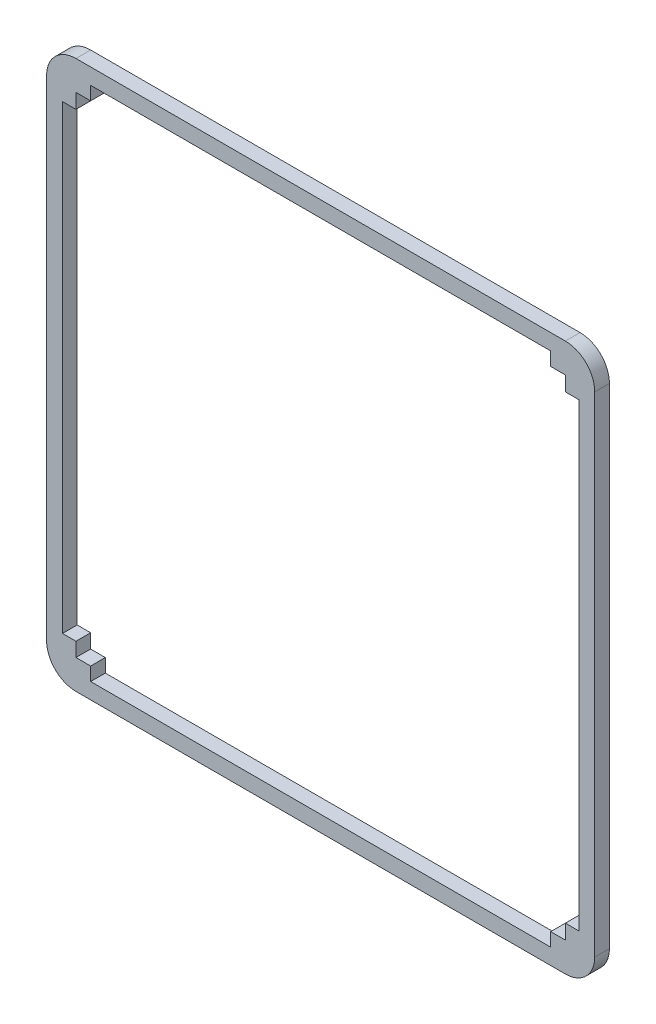
ISO-10303-21;
HEADER;
FILE_DESCRIPTION(('STEP AP214'),'2;1');
FILE_NAME('part.step','',(''),(''),'','','');
FILE_SCHEMA(('AUTOMOTIVE_DESIGN { 1 0 10303 214 1 1 1 1 }'));
ENDSEC;
DATA;
#1=APPLICATION_CONTEXT('core data for automotive mechanical design processes');
#2=APPLICATION_PROTOCOL_DEFINITION('international standard','automotive_design',2000,#1);
#3=PRODUCT_CONTEXT('',#1,'mechanical');
#4=PRODUCT('Part','Part','',(#3));
#5=PRODUCT_RELATED_PRODUCT_CATEGORY('part','',(#4));
#6=PRODUCT_DEFINITION_FORMATION('','',#4);
#7=PRODUCT_DEFINITION_CONTEXT('part definition',#1,'design');
#8=PRODUCT_DEFINITION('design','',#6,#7);
#9=PRODUCT_DEFINITION_SHAPE('','',#8);
#10=(LENGTH_UNIT() NAMED_UNIT(*) SI_UNIT(.MILLI.,.METRE.));
#11=(NAMED_UNIT(*) PLANE_ANGLE_UNIT() SI_UNIT($,.RADIAN.));
#12=(NAMED_UNIT(*) SI_UNIT($,.STERADIAN.) SOLID_ANGLE_UNIT());
#13=UNCERTAINTY_MEASURE_WITH_UNIT(LENGTH_MEASURE(1.E-05),#10,'distance_accuracy_value','');
#14=(GEOMETRIC_REPRESENTATION_CONTEXT(3) GLOBAL_UNCERTAINTY_ASSIGNED_CONTEXT((#13)) GLOBAL_UNIT_ASSIGNED_CONTEXT((#10,
#11,#12)) REPRESENTATION_CONTEXT('',''));
#15=CARTESIAN_POINT('',(0.,0.,0.));
#16=DIRECTION('',(0.,0.,1.));
#17=DIRECTION('',(1.,0.,0.));
#18=AXIS2_PLACEMENT_3D('',#15,#16,#17);
#19=CARTESIAN_POINT('',(0.,-6.,3.));
#20=DIRECTION('',(0.,1.,0.));
#21=DIRECTION('',(0.,0.,1.));
#22=AXIS2_PLACEMENT_3D('',#19,#20,#21);
#23=PLANE('',#22);
#24=DIRECTION('',(1.,0.,0.));
#25=VECTOR('',#24,1.);
#26=CARTESIAN_POINT('',(0.,-6.,0.));
#27=LINE('',#26,#25);
#28=CARTESIAN_POINT('',(0.,-6.,0.));
#29=VERTEX_POINT('',#28);
#30=CARTESIAN_POINT('',(100.,-6.,0.));
#31=VERTEX_POINT('',#30);
#32=EDGE_CURVE('E335',#29,#31,#27,.T.);
#33=ORIENTED_EDGE('',*,*,#32,.T.);
#34=DIRECTION('',(0.,0.,-1.));
#35=VECTOR('',#34,1.);
#36=CARTESIAN_POINT('',(100.,-6.,3.));
#37=LINE('',#36,#35);
#38=CARTESIAN_POINT('',(100.,-6.,3.));
#39=VERTEX_POINT('',#38);
#40=EDGE_CURVE('E11',#39,#31,#37,.T.);
#41=ORIENTED_EDGE('',*,*,#40,.F.);
#42=DIRECTION('',(1.,0.,0.));
#43=VECTOR('',#42,1.);
#44=CARTESIAN_POINT('',(0.,-6.,3.));
#45=LINE('',#44,#43);
#46=CARTESIAN_POINT('',(0.,-6.,3.));
#47=VERTEX_POINT('',#46);
#48=EDGE_CURVE('E474',#47,#39,#45,.T.);
#49=ORIENTED_EDGE('',*,*,#48,.F.);
#50=DIRECTION('',(0.,0.,-1.));
#51=VECTOR('',#50,1.);
#52=CARTESIAN_POINT('',(0.,-6.,3.));
#53=LINE('',#52,#51);
#54=EDGE_CURVE('E61',#47,#29,#53,.T.);
#55=ORIENTED_EDGE('',*,*,#54,.T.);
#56=EDGE_LOOP('',(#33,#41,#49,#55));
#57=FACE_BOUND('',#56,.T.);
#58=ADVANCED_FACE('F41',(#57),#23,.F.);
#59=CARTESIAN_POINT('',(100.,0.,3.));
#60=DIRECTION('',(0.,0.,-1.));
#61=DIRECTION('',(-1.,0.,0.));
#62=AXIS2_PLACEMENT_3D('',#59,#60,#61);
#63=CYLINDRICAL_SURFACE('',#62,6.00000000000001);
#64=CARTESIAN_POINT('',(100.,0.,0.));
#65=DIRECTION('',(0.,0.,1.));
#66=DIRECTION('',(1.,0.,0.));
#67=AXIS2_PLACEMENT_3D('',#64,#65,#66);
#68=CIRCLE('',#67,6.00000000000001);
#69=CARTESIAN_POINT('',(106.,0.,0.));
#70=VERTEX_POINT('',#69);
#71=EDGE_CURVE('E338',#31,#70,#68,.T.);
#72=ORIENTED_EDGE('',*,*,#71,.T.);
#73=DIRECTION('',(0.,0.,-1.));
#74=VECTOR('',#73,1.);
#75=CARTESIAN_POINT('',(106.,0.,3.));
#76=LINE('',#75,#74);
#77=CARTESIAN_POINT('',(106.,0.,3.));
#78=VERTEX_POINT('',#77);
#79=EDGE_CURVE('E52',#78,#70,#76,.T.);
#80=ORIENTED_EDGE('',*,*,#79,.F.);
#81=CARTESIAN_POINT('',(100.,0.,3.));
#82=DIRECTION('',(0.,0.,1.));
#83=DIRECTION('',(1.,0.,0.));
#84=AXIS2_PLACEMENT_3D('',#81,#82,#83);
#85=CIRCLE('',#84,6.00000000000001);
#86=EDGE_CURVE('E480',#39,#78,#85,.T.);
#87=ORIENTED_EDGE('',*,*,#86,.F.);
#88=ORIENTED_EDGE('',*,*,#40,.T.);
#89=EDGE_LOOP('',(#72,#80,#87,#88));
#90=FACE_BOUND('',#89,.T.);
#91=ADVANCED_FACE('F607',(#90),#63,.T.);
#92=CARTESIAN_POINT('',(106.,0.,3.));
#93=DIRECTION('',(-1.,0.,0.));
#94=DIRECTION('',(0.,0.,1.));
#95=AXIS2_PLACEMENT_3D('',#92,#93,#94);
#96=PLANE('',#95);
#97=DIRECTION('',(0.,1.,0.));
#98=VECTOR('',#97,1.);
#99=CARTESIAN_POINT('',(106.,0.,0.));
#100=LINE('',#99,#98);
#101=CARTESIAN_POINT('',(106.,100.,0.));
#102=VERTEX_POINT('',#101);
#103=EDGE_CURVE('E341',#70,#102,#100,.T.);
#104=ORIENTED_EDGE('',*,*,#103,.T.);
#105=DIRECTION('',(0.,0.,-1.));
#106=VECTOR('',#105,1.);
#107=CARTESIAN_POINT('',(106.,100.,3.));
#108=LINE('',#107,#106);
#109=CARTESIAN_POINT('',(106.,100.,3.));
#110=VERTEX_POINT('',#109);
#111=EDGE_CURVE('E371',#110,#102,#108,.T.);
#112=ORIENTED_EDGE('',*,*,#111,.F.);
#113=DIRECTION('',(0.,1.,0.));
#114=VECTOR('',#113,1.);
#115=CARTESIAN_POINT('',(106.,0.,3.));
#116=LINE('',#115,#114);
#117=EDGE_CURVE('E579',#78,#110,#116,.T.);
#118=ORIENTED_EDGE('',*,*,#117,.F.);
#119=ORIENTED_EDGE('',*,*,#79,.T.);
#120=EDGE_LOOP('',(#104,#112,#118,#119));
#121=FACE_BOUND('',#120,.T.);
#122=ADVANCED_FACE('F612',(#121),#96,.F.);
#123=CARTESIAN_POINT('',(100.,100.,3.));
#124=DIRECTION('',(0.,0.,-1.));
#125=DIRECTION('',(-1.,0.,0.));
#126=AXIS2_PLACEMENT_3D('',#123,#124,#125);
#127=CYLINDRICAL_SURFACE('',#126,6.00000000000003);
#128=CARTESIAN_POINT('',(100.,100.,0.));
#129=DIRECTION('',(0.,0.,1.));
#130=DIRECTION('',(1.,0.,0.));
#131=AXIS2_PLACEMENT_3D('',#128,#129,#130);
#132=CIRCLE('',#131,6.00000000000003);
#133=CARTESIAN_POINT('',(100.,106.,0.));
#134=VERTEX_POINT('',#133);
#135=EDGE_CURVE('E344',#102,#134,#132,.T.);
#136=ORIENTED_EDGE('',*,*,#135,.T.);
#137=DIRECTION('',(0.,0.,-1.));
#138=VECTOR('',#137,1.);
#139=CARTESIAN_POINT('',(100.,106.,3.));
#140=LINE('',#139,#138);
#141=CARTESIAN_POINT('',(100.,106.,3.));
#142=VERTEX_POINT('',#141);
#143=EDGE_CURVE('E368',#142,#134,#140,.T.);
#144=ORIENTED_EDGE('',*,*,#143,.F.);
#145=CARTESIAN_POINT('',(100.,100.,3.));
#146=DIRECTION('',(0.,0.,1.));
#147=DIRECTION('',(1.,0.,0.));
#148=AXIS2_PLACEMENT_3D('',#145,#146,#147);
#149=CIRCLE('',#148,6.00000000000003);
#150=EDGE_CURVE('E263',#110,#142,#149,.T.);
#151=ORIENTED_EDGE('',*,*,#150,.F.);
#152=ORIENTED_EDGE('',*,*,#111,.T.);
#153=EDGE_LOOP('',(#136,#144,#151,#152));
#154=FACE_BOUND('',#153,.T.);
#155=ADVANCED_FACE('F587',(#154),#127,.T.);
#156=CARTESIAN_POINT('',(0.,106.,3.));
#157=DIRECTION('',(0.,1.,0.));
#158=DIRECTION('',(0.,0.,1.));
#159=AXIS2_PLACEMENT_3D('',#156,#157,#158);
#160=PLANE('',#159);
#161=DIRECTION('',(1.,0.,0.));
#162=VECTOR('',#161,1.);
#163=CARTESIAN_POINT('',(0.,106.,0.));
#164=LINE('',#163,#162);
#165=CARTESIAN_POINT('',(0.,106.,0.));
#166=VERTEX_POINT('',#165);
#167=EDGE_CURVE('E348',#166,#134,#164,.T.);
#168=ORIENTED_EDGE('',*,*,#167,.F.);
#169=DIRECTION('',(0.,0.,-1.));
#170=VECTOR('',#169,1.);
#171=CARTESIAN_POINT('',(0.,106.,3.));
#172=LINE('',#171,#170);
#173=CARTESIAN_POINT('',(0.,106.,3.));
#174=VERTEX_POINT('',#173);
#175=EDGE_CURVE('E246',#174,#166,#172,.T.);
#176=ORIENTED_EDGE('',*,*,#175,.F.);
#177=DIRECTION('',(1.,0.,0.));
#178=VECTOR('',#177,1.);
#179=CARTESIAN_POINT('',(0.,106.,3.));
#180=LINE('',#179,#178);
#181=EDGE_CURVE('E259',#174,#142,#180,.T.);
#182=ORIENTED_EDGE('',*,*,#181,.T.);
#183=ORIENTED_EDGE('',*,*,#143,.T.);
#184=EDGE_LOOP('',(#168,#176,#182,#183));
#185=FACE_BOUND('',#184,.T.);
#186=ADVANCED_FACE('F591',(#185),#160,.T.);
#187=CARTESIAN_POINT('',(0.,100.,3.));
#188=DIRECTION('',(0.,0.,-1.));
#189=DIRECTION('',(-1.,0.,0.));
#190=AXIS2_PLACEMENT_3D('',#187,#188,#189);
#191=CYLINDRICAL_SURFACE('',#190,6.00000000000001);
#192=CARTESIAN_POINT('',(0.,100.,0.));
#193=DIRECTION('',(0.,0.,1.));
#194=DIRECTION('',(1.,0.,0.));
#195=AXIS2_PLACEMENT_3D('',#192,#193,#194);
#196=CIRCLE('',#195,6.00000000000001);
#197=CARTESIAN_POINT('',(-6.,100.,0.));
#198=VERTEX_POINT('',#197);
#199=EDGE_CURVE('E242',#198,#166,#196,.F.);
#200=ORIENTED_EDGE('',*,*,#199,.F.);
#201=DIRECTION('',(0.,0.,-1.));
#202=VECTOR('',#201,1.);
#203=CARTESIAN_POINT('',(-6.,100.,3.));
#204=LINE('',#203,#202);
#205=CARTESIAN_POINT('',(-6.,100.,3.));
#206=VERTEX_POINT('',#205);
#207=EDGE_CURVE('E236',#206,#198,#204,.T.);
#208=ORIENTED_EDGE('',*,*,#207,.F.);
#209=CARTESIAN_POINT('',(0.,100.,3.));
#210=DIRECTION('',(0.,0.,1.));
#211=DIRECTION('',(1.,0.,0.));
#212=AXIS2_PLACEMENT_3D('',#209,#210,#211);
#213=CIRCLE('',#212,6.00000000000001);
#214=EDGE_CURVE('E240',#206,#174,#213,.F.);
#215=ORIENTED_EDGE('',*,*,#214,.T.);
#216=ORIENTED_EDGE('',*,*,#175,.T.);
#217=EDGE_LOOP('',(#200,#208,#215,#216));
#218=FACE_BOUND('',#217,.T.);
#219=ADVANCED_FACE('F238',(#218),#191,.T.);
#220=CARTESIAN_POINT('',(-5.99999999999999,0.,3.));
#221=DIRECTION('',(1.,0.,0.));
#222=DIRECTION('',(0.,1.,0.));
#223=AXIS2_PLACEMENT_3D('',#220,#221,#222);
#224=PLANE('',#223);
#225=DIRECTION('',(0.,-1.,0.));
#226=VECTOR('',#225,1.);
#227=CARTESIAN_POINT('',(-5.99999999999999,0.,0.));
#228=LINE('',#227,#226);
#229=CARTESIAN_POINT('',(-5.99999999999999,0.,0.));
#230=VERTEX_POINT('',#229);
#231=EDGE_CURVE('E354',#198,#230,#228,.T.);
#232=ORIENTED_EDGE('',*,*,#231,.T.);
#233=DIRECTION('',(0.,0.,-1.));
#234=VECTOR('',#233,1.);
#235=CARTESIAN_POINT('',(-5.99999999999999,0.,3.));
#236=LINE('',#235,#234);
#237=CARTESIAN_POINT('',(-5.99999999999999,0.,3.));
#238=VERTEX_POINT('',#237);
#239=EDGE_CURVE('E148',#238,#230,#236,.T.);
#240=ORIENTED_EDGE('',*,*,#239,.F.);
#241=DIRECTION('',(0.,-1.,0.));
#242=VECTOR('',#241,1.);
#243=CARTESIAN_POINT('',(-5.99999999999999,0.,3.));
#244=LINE('',#243,#242);
#245=EDGE_CURVE('E248',#206,#238,#244,.T.);
#246=ORIENTED_EDGE('',*,*,#245,.F.);
#247=ORIENTED_EDGE('',*,*,#207,.T.);
#248=EDGE_LOOP('',(#232,#240,#246,#247));
#249=FACE_BOUND('',#248,.T.);
#250=ADVANCED_FACE('F249',(#249),#224,.F.);
#251=CARTESIAN_POINT('',(0.,2.88549192762695,3.));
#252=DIRECTION('',(0.,1.,0.));
#253=DIRECTION('',(0.,0.,1.));
#254=AXIS2_PLACEMENT_3D('',#251,#252,#253);
#255=PLANE('',#254);
#256=DIRECTION('',(1.,0.,0.));
#257=VECTOR('',#256,1.);
#258=CARTESIAN_POINT('',(0.,2.88549192762695,0.));
#259=LINE('',#258,#257);
#260=CARTESIAN_POINT('',(-2.75,2.88549192762695,0.));
#261=VERTEX_POINT('',#260);
#262=CARTESIAN_POINT('',(0.,2.88549192762695,0.));
#263=VERTEX_POINT('',#262);
#264=EDGE_CURVE('E270',#261,#263,#259,.T.);
#265=ORIENTED_EDGE('',*,*,#264,.F.);
#266=DIRECTION('',(0.,0.,-1.));
#267=VECTOR('',#266,1.);
#268=CARTESIAN_POINT('',(-2.75,2.88549192762695,3.));
#269=LINE('',#268,#267);
#270=CARTESIAN_POINT('',(-2.75,2.88549192762695,3.));
#271=VERTEX_POINT('',#270);
#272=EDGE_CURVE('E45',#271,#261,#269,.T.);
#273=ORIENTED_EDGE('',*,*,#272,.F.);
#274=DIRECTION('',(1.,0.,0.));
#275=VECTOR('',#274,1.);
#276=CARTESIAN_POINT('',(0.,2.88549192762695,3.));
#277=LINE('',#276,#275);
#278=CARTESIAN_POINT('',(0.,2.88549192762695,3.));
#279=VERTEX_POINT('',#278);
#280=EDGE_CURVE('E361',#271,#279,#277,.T.);
#281=ORIENTED_EDGE('',*,*,#280,.T.);
#282=DIRECTION('',(0.,0.,-1.));
#283=VECTOR('',#282,1.);
#284=CARTESIAN_POINT('',(0.,2.88549192762695,3.));
#285=LINE('',#284,#283);
#286=EDGE_CURVE('E269',#279,#263,#285,.T.);
#287=ORIENTED_EDGE('',*,*,#286,.T.);
#288=EDGE_LOOP('',(#265,#273,#281,#287));
#289=FACE_BOUND('',#288,.T.);
#290=ADVANCED_FACE('F43',(#289),#255,.T.);
#291=CARTESIAN_POINT('',(-2.75,0.,3.));
#292=DIRECTION('',(1.,0.,0.));
#293=DIRECTION('',(0.,0.,-1.));
#294=AXIS2_PLACEMENT_3D('',#291,#292,#293);
#295=PLANE('',#294);
#296=DIRECTION('',(0.,-1.,0.));
#297=VECTOR('',#296,1.);
#298=CARTESIAN_POINT('',(-2.75,0.,0.));
#299=LINE('',#298,#297);
#300=CARTESIAN_POINT('',(-2.75,97.,0.));
#301=VERTEX_POINT('',#300);
#302=EDGE_CURVE('E274',#301,#261,#299,.T.);
#303=ORIENTED_EDGE('',*,*,#302,.F.);
#304=DIRECTION('',(0.,0.,-1.));
#305=VECTOR('',#304,1.);
#306=CARTESIAN_POINT('',(-2.75,97.,3.));
#307=LINE('',#306,#305);
#308=CARTESIAN_POINT('',(-2.75,97.,3.));
#309=VERTEX_POINT('',#308);
#310=EDGE_CURVE('E433',#309,#301,#307,.T.);
#311=ORIENTED_EDGE('',*,*,#310,.F.);
#312=DIRECTION('',(0.,-1.,0.));
#313=VECTOR('',#312,1.);
#314=CARTESIAN_POINT('',(-2.75,0.,3.));
#315=LINE('',#314,#313);
#316=EDGE_CURVE('E444',#309,#271,#315,.T.);
#317=ORIENTED_EDGE('',*,*,#316,.T.);
#318=ORIENTED_EDGE('',*,*,#272,.T.);
#319=EDGE_LOOP('',(#303,#311,#317,#318));
#320=FACE_BOUND('',#319,.T.);
#321=ADVANCED_FACE('F442',(#320),#295,.T.);
#322=CARTESIAN_POINT('',(0.,97.,3.));
#323=DIRECTION('',(0.,1.,0.));
#324=DIRECTION('',(0.,0.,1.));
#325=AXIS2_PLACEMENT_3D('',#322,#323,#324);
#326=PLANE('',#325);
#327=DIRECTION('',(1.,0.,0.));
#328=VECTOR('',#327,1.);
#329=CARTESIAN_POINT('',(0.,97.,0.));
#330=LINE('',#329,#328);
#331=CARTESIAN_POINT('',(0.,97.,0.));
#332=VERTEX_POINT('',#331);
#333=EDGE_CURVE('E278',#301,#332,#330,.T.);
#334=ORIENTED_EDGE('',*,*,#333,.T.);
#335=DIRECTION('',(0.,0.,-1.));
#336=VECTOR('',#335,1.);
#337=CARTESIAN_POINT('',(0.,97.,3.));
#338=LINE('',#337,#336);
#339=CARTESIAN_POINT('',(0.,97.,3.));
#340=VERTEX_POINT('',#339);
#341=EDGE_CURVE('E430',#340,#332,#338,.T.);
#342=ORIENTED_EDGE('',*,*,#341,.F.);
#343=DIRECTION('',(1.,0.,0.));
#344=VECTOR('',#343,1.);
#345=CARTESIAN_POINT('',(0.,97.,3.));
#346=LINE('',#345,#344);
#347=EDGE_CURVE('E464',#309,#340,#346,.T.);
#348=ORIENTED_EDGE('',*,*,#347,.F.);
#349=ORIENTED_EDGE('',*,*,#310,.T.);
#350=EDGE_LOOP('',(#334,#342,#348,#349));
#351=FACE_BOUND('',#350,.T.);
#352=ADVANCED_FACE('F454',(#351),#326,.F.);
#353=CARTESIAN_POINT('',(0.,0.,3.));
#354=DIRECTION('',(-1.,0.,0.));
#355=DIRECTION('',(0.,0.,1.));
#356=AXIS2_PLACEMENT_3D('',#353,#354,#355);
#357=PLANE('',#356);
#358=DIRECTION('',(0.,1.,0.));
#359=VECTOR('',#358,1.);
#360=CARTESIAN_POINT('',(0.,0.,0.));
#361=LINE('',#360,#359);
#362=CARTESIAN_POINT('',(0.,100.,0.));
#363=VERTEX_POINT('',#362);
#364=EDGE_CURVE('E281',#332,#363,#361,.T.);
#365=ORIENTED_EDGE('',*,*,#364,.T.);
#366=DIRECTION('',(0.,0.,-1.));
#367=VECTOR('',#366,1.);
#368=CARTESIAN_POINT('',(0.,100.,3.));
#369=LINE('',#368,#367);
#370=CARTESIAN_POINT('',(0.,100.,3.));
#371=VERTEX_POINT('',#370);
#372=EDGE_CURVE('E426',#371,#363,#369,.T.);
#373=ORIENTED_EDGE('',*,*,#372,.F.);
#374=DIRECTION('',(0.,1.,0.));
#375=VECTOR('',#374,1.);
#376=CARTESIAN_POINT('',(0.,0.,3.));
#377=LINE('',#376,#375);
#378=EDGE_CURVE('E459',#340,#371,#377,.T.);
#379=ORIENTED_EDGE('',*,*,#378,.F.);
#380=ORIENTED_EDGE('',*,*,#341,.T.);
#381=EDGE_LOOP('',(#365,#373,#379,#380));
#382=FACE_BOUND('',#381,.T.);
#383=ADVANCED_FACE('F457',(#382),#357,.F.);
#384=CARTESIAN_POINT('',(0.,100.,3.));
#385=DIRECTION('',(0.,1.,0.));
#386=DIRECTION('',(0.,0.,1.));
#387=AXIS2_PLACEMENT_3D('',#384,#385,#386);
#388=PLANE('',#387);
#389=DIRECTION('',(1.,0.,0.));
#390=VECTOR('',#389,1.);
#391=CARTESIAN_POINT('',(0.,100.,0.));
#392=LINE('',#391,#390);
#393=CARTESIAN_POINT('',(3.,100.,0.));
#394=VERTEX_POINT('',#393);
#395=EDGE_CURVE('E284',#363,#394,#392,.T.);
#396=ORIENTED_EDGE('',*,*,#395,.T.);
#397=DIRECTION('',(0.,0.,-1.));
#398=VECTOR('',#397,1.);
#399=CARTESIAN_POINT('',(3.,100.,3.));
#400=LINE('',#399,#398);
#401=CARTESIAN_POINT('',(3.,100.,3.));
#402=VERTEX_POINT('',#401);
#403=EDGE_CURVE('E423',#402,#394,#400,.T.);
#404=ORIENTED_EDGE('',*,*,#403,.F.);
#405=DIRECTION('',(1.,0.,0.));
#406=VECTOR('',#405,1.);
#407=CARTESIAN_POINT('',(0.,100.,3.));
#408=LINE('',#407,#406);
#409=EDGE_CURVE('E463',#371,#402,#408,.T.);
#410=ORIENTED_EDGE('',*,*,#409,.F.);
#411=ORIENTED_EDGE('',*,*,#372,.T.);
#412=EDGE_LOOP('',(#396,#404,#410,#411));
#413=FACE_BOUND('',#412,.T.);
#414=ADVANCED_FACE('F639',(#413),#388,.F.);
#415=CARTESIAN_POINT('',(3.00000000000002,0.,3.));
#416=DIRECTION('',(1.,0.,0.));
#417=DIRECTION('',(0.,1.,0.));
#418=AXIS2_PLACEMENT_3D('',#415,#416,#417);
#419=PLANE('',#418);
#420=DIRECTION('',(0.,-1.,0.));
#421=VECTOR('',#420,1.);
#422=CARTESIAN_POINT('',(3.00000000000002,0.,0.));
#423=LINE('',#422,#421);
#424=CARTESIAN_POINT('',(3.,102.75,0.));
#425=VERTEX_POINT('',#424);
#426=EDGE_CURVE('E289',#425,#394,#423,.T.);
#427=ORIENTED_EDGE('',*,*,#426,.F.);
#428=DIRECTION('',(0.,0.,-1.));
#429=VECTOR('',#428,1.);
#430=CARTESIAN_POINT('',(3.,102.75,3.));
#431=LINE('',#430,#429);
#432=CARTESIAN_POINT('',(3.,102.75,3.));
#433=VERTEX_POINT('',#432);
#434=EDGE_CURVE('E420',#433,#425,#431,.T.);
#435=ORIENTED_EDGE('',*,*,#434,.F.);
#436=DIRECTION('',(0.,-1.,0.));
#437=VECTOR('',#436,1.);
#438=CARTESIAN_POINT('',(3.00000000000002,0.,3.));
#439=LINE('',#438,#437);
#440=EDGE_CURVE('E469',#433,#402,#439,.T.);
#441=ORIENTED_EDGE('',*,*,#440,.T.);
#442=ORIENTED_EDGE('',*,*,#403,.T.);
#443=EDGE_LOOP('',(#427,#435,#441,#442));
#444=FACE_BOUND('',#443,.T.);
#445=ADVANCED_FACE('F644',(#444),#419,.T.);
#446=CARTESIAN_POINT('',(-2.88222460083039E-13,102.75,3.));
#447=DIRECTION('',(0.,-1.,0.));
#448=DIRECTION('',(1.,0.,0.));
#449=AXIS2_PLACEMENT_3D('',#446,#447,#448);
#450=PLANE('',#449);
#451=DIRECTION('',(-1.,0.,0.));
#452=VECTOR('',#451,1.);
#453=CARTESIAN_POINT('',(-2.88222460083039E-13,102.75,0.));
#454=LINE('',#453,#452);
#455=CARTESIAN_POINT('',(97.,102.75,0.));
#456=VERTEX_POINT('',#455);
#457=EDGE_CURVE('E294',#456,#425,#454,.T.);
#458=ORIENTED_EDGE('',*,*,#457,.F.);
#459=DIRECTION('',(0.,0.,-1.));
#460=VECTOR('',#459,1.);
#461=CARTESIAN_POINT('',(97.,102.75,3.));
#462=LINE('',#461,#460);
#463=CARTESIAN_POINT('',(97.,102.75,3.));
#464=VERTEX_POINT('',#463);
#465=EDGE_CURVE('E417',#464,#456,#462,.T.);
#466=ORIENTED_EDGE('',*,*,#465,.F.);
#467=DIRECTION('',(-1.,0.,0.));
#468=VECTOR('',#467,1.);
#469=CARTESIAN_POINT('',(-2.88222460083039E-13,102.75,3.));
#470=LINE('',#469,#468);
#471=EDGE_CURVE('E525',#464,#433,#470,.T.);
#472=ORIENTED_EDGE('',*,*,#471,.T.);
#473=ORIENTED_EDGE('',*,*,#434,.T.);
#474=EDGE_LOOP('',(#458,#466,#472,#473));
#475=FACE_BOUND('',#474,.T.);
#476=ADVANCED_FACE('F535',(#475),#450,.T.);
#477=CARTESIAN_POINT('',(97.,0.,3.));
#478=DIRECTION('',(-1.,0.,0.));
#479=DIRECTION('',(0.,0.,1.));
#480=AXIS2_PLACEMENT_3D('',#477,#478,#479);
#481=PLANE('',#480);
#482=DIRECTION('',(0.,1.,0.));
#483=VECTOR('',#482,1.);
#484=CARTESIAN_POINT('',(97.,0.,0.));
#485=LINE('',#484,#483);
#486=CARTESIAN_POINT('',(97.,100.,0.));
#487=VERTEX_POINT('',#486);
#488=EDGE_CURVE('E298',#487,#456,#485,.T.);
#489=ORIENTED_EDGE('',*,*,#488,.F.);
#490=DIRECTION('',(0.,0.,-1.));
#491=VECTOR('',#490,1.);
#492=CARTESIAN_POINT('',(97.,100.,3.));
#493=LINE('',#492,#491);
#494=CARTESIAN_POINT('',(97.,100.,3.));
#495=VERTEX_POINT('',#494);
#496=EDGE_CURVE('E414',#495,#487,#493,.T.);
#497=ORIENTED_EDGE('',*,*,#496,.F.);
#498=DIRECTION('',(0.,1.,0.));
#499=VECTOR('',#498,1.);
#500=CARTESIAN_POINT('',(97.,0.,3.));
#501=LINE('',#500,#499);
#502=EDGE_CURVE('E519',#495,#464,#501,.T.);
#503=ORIENTED_EDGE('',*,*,#502,.T.);
#504=ORIENTED_EDGE('',*,*,#465,.T.);
#505=EDGE_LOOP('',(#489,#497,#503,#504));
#506=FACE_BOUND('',#505,.T.);
#507=ADVANCED_FACE('F540',(#506),#481,.T.);
#508=CARTESIAN_POINT('',(100.,100.,0.));
#509=VERTEX_POINT('',#508);
#510=EDGE_CURVE('E290',#487,#509,#392,.T.);
#511=ORIENTED_EDGE('',*,*,#510,.T.);
#512=DIRECTION('',(0.,0.,-1.));
#513=VECTOR('',#512,1.);
#514=CARTESIAN_POINT('',(100.,100.,3.));
#515=LINE('',#514,#513);
#516=CARTESIAN_POINT('',(100.,100.,3.));
#517=VERTEX_POINT('',#516);
#518=EDGE_CURVE('E411',#517,#509,#515,.T.);
#519=ORIENTED_EDGE('',*,*,#518,.F.);
#520=EDGE_CURVE('E471',#495,#517,#408,.T.);
#521=ORIENTED_EDGE('',*,*,#520,.F.);
#522=ORIENTED_EDGE('',*,*,#496,.T.);
#523=EDGE_LOOP('',(#511,#519,#521,#522));
#524=FACE_BOUND('',#523,.T.);
#525=ADVANCED_FACE('F544',(#524),#388,.F.);
#526=CARTESIAN_POINT('',(100.,0.,3.));
#527=DIRECTION('',(-1.,0.,0.));
#528=DIRECTION('',(0.,0.,1.));
#529=AXIS2_PLACEMENT_3D('',#526,#527,#528);
#530=PLANE('',#529);
#531=DIRECTION('',(0.,1.,0.));
#532=VECTOR('',#531,1.);
#533=CARTESIAN_POINT('',(100.,0.,0.));
#534=LINE('',#533,#532);
#535=CARTESIAN_POINT('',(100.,97.,0.));
#536=VERTEX_POINT('',#535);
#537=EDGE_CURVE('E302',#536,#509,#534,.T.);
#538=ORIENTED_EDGE('',*,*,#537,.F.);
#539=DIRECTION('',(0.,0.,-1.));
#540=VECTOR('',#539,1.);
#541=CARTESIAN_POINT('',(100.,97.,3.));
#542=LINE('',#541,#540);
#543=CARTESIAN_POINT('',(100.,97.,3.));
#544=VERTEX_POINT('',#543);
#545=EDGE_CURVE('E408',#544,#536,#542,.T.);
#546=ORIENTED_EDGE('',*,*,#545,.F.);
#547=DIRECTION('',(0.,1.,0.));
#548=VECTOR('',#547,1.);
#549=CARTESIAN_POINT('',(100.,0.,3.));
#550=LINE('',#549,#548);
#551=EDGE_CURVE('E504',#544,#517,#550,.T.);
#552=ORIENTED_EDGE('',*,*,#551,.T.);
#553=ORIENTED_EDGE('',*,*,#518,.T.);
#554=EDGE_LOOP('',(#538,#546,#552,#553));
#555=FACE_BOUND('',#554,.T.);
#556=ADVANCED_FACE('F546',(#555),#530,.T.);
#557=CARTESIAN_POINT('',(0.,97.,3.));
#558=DIRECTION('',(0.,-1.,0.));
#559=DIRECTION('',(0.,0.,-1.));
#560=AXIS2_PLACEMENT_3D('',#557,#558,#559);
#561=PLANE('',#560);
#562=DIRECTION('',(-1.,0.,0.));
#563=VECTOR('',#562,1.);
#564=CARTESIAN_POINT('',(0.,97.,0.));
#565=LINE('',#564,#563);
#566=CARTESIAN_POINT('',(102.75,97.,0.));
#567=VERTEX_POINT('',#566);
#568=EDGE_CURVE('E306',#567,#536,#565,.T.);
#569=ORIENTED_EDGE('',*,*,#568,.F.);
#570=DIRECTION('',(0.,0.,-1.));
#571=VECTOR('',#570,1.);
#572=CARTESIAN_POINT('',(102.75,97.,3.));
#573=LINE('',#572,#571);
#574=CARTESIAN_POINT('',(102.75,97.,3.));
#575=VERTEX_POINT('',#574);
#576=EDGE_CURVE('E405',#575,#567,#573,.T.);
#577=ORIENTED_EDGE('',*,*,#576,.F.);
#578=DIRECTION('',(-1.,0.,0.));
#579=VECTOR('',#578,1.);
#580=CARTESIAN_POINT('',(0.,97.,3.));
#581=LINE('',#580,#579);
#582=EDGE_CURVE('E513',#575,#544,#581,.T.);
#583=ORIENTED_EDGE('',*,*,#582,.T.);
#584=ORIENTED_EDGE('',*,*,#545,.T.);
#585=EDGE_LOOP('',(#569,#577,#583,#584));
#586=FACE_BOUND('',#585,.T.);
#587=ADVANCED_FACE('F551',(#586),#561,.T.);
#588=CARTESIAN_POINT('',(102.75,0.,3.));
#589=DIRECTION('',(-1.,0.,0.));
#590=DIRECTION('',(0.,0.,1.));
#591=AXIS2_PLACEMENT_3D('',#588,#589,#590);
#592=PLANE('',#591);
#593=DIRECTION('',(0.,1.,0.));
#594=VECTOR('',#593,1.);
#595=CARTESIAN_POINT('',(102.75,0.,0.));
#596=LINE('',#595,#594);
#597=CARTESIAN_POINT('',(102.75,3.,0.));
#598=VERTEX_POINT('',#597);
#599=EDGE_CURVE('E311',#598,#567,#596,.T.);
#600=ORIENTED_EDGE('',*,*,#599,.F.);
#601=DIRECTION('',(0.,0.,-1.));
#602=VECTOR('',#601,1.);
#603=CARTESIAN_POINT('',(102.75,3.,3.));
#604=LINE('',#603,#602);
#605=CARTESIAN_POINT('',(102.75,3.,3.));
#606=VERTEX_POINT('',#605);
#607=EDGE_CURVE('E402',#606,#598,#604,.T.);
#608=ORIENTED_EDGE('',*,*,#607,.F.);
#609=DIRECTION('',(0.,1.,0.));
#610=VECTOR('',#609,1.);
#611=CARTESIAN_POINT('',(102.75,0.,3.));
#612=LINE('',#611,#610);
#613=EDGE_CURVE('E508',#606,#575,#612,.T.);
#614=ORIENTED_EDGE('',*,*,#613,.T.);
#615=ORIENTED_EDGE('',*,*,#576,.T.);
#616=EDGE_LOOP('',(#600,#608,#614,#615));
#617=FACE_BOUND('',#616,.T.);
#618=ADVANCED_FACE('F556',(#617),#592,.T.);
#619=CARTESIAN_POINT('',(0.,2.99999999999998,3.));
#620=DIRECTION('',(0.,-1.,0.));
#621=DIRECTION('',(1.,0.,0.));
#622=AXIS2_PLACEMENT_3D('',#619,#620,#621);
#623=PLANE('',#622);
#624=DIRECTION('',(-1.,0.,0.));
#625=VECTOR('',#624,1.);
#626=CARTESIAN_POINT('',(0.,2.99999999999998,0.));
#627=LINE('',#626,#625);
#628=CARTESIAN_POINT('',(100.,3.,0.));
#629=VERTEX_POINT('',#628);
#630=EDGE_CURVE('E315',#598,#629,#627,.T.);
#631=ORIENTED_EDGE('',*,*,#630,.T.);
#632=DIRECTION('',(0.,0.,-1.));
#633=VECTOR('',#632,1.);
#634=CARTESIAN_POINT('',(100.,3.,3.));
#635=LINE('',#634,#633);
#636=CARTESIAN_POINT('',(100.,3.,3.));
#637=VERTEX_POINT('',#636);
#638=EDGE_CURVE('E399',#637,#629,#635,.T.);
#639=ORIENTED_EDGE('',*,*,#638,.F.);
#640=DIRECTION('',(-1.,0.,0.));
#641=VECTOR('',#640,1.);
#642=CARTESIAN_POINT('',(0.,2.99999999999998,3.));
#643=LINE('',#642,#641);
#644=EDGE_CURVE('E502',#606,#637,#643,.T.);
#645=ORIENTED_EDGE('',*,*,#644,.F.);
#646=ORIENTED_EDGE('',*,*,#607,.T.);
#647=EDGE_LOOP('',(#631,#639,#645,#646));
#648=FACE_BOUND('',#647,.T.);
#649=ADVANCED_FACE('F562',(#648),#623,.F.);
#650=CARTESIAN_POINT('',(100.,0.,0.));
#651=VERTEX_POINT('',#650);
#652=EDGE_CURVE('E307',#651,#629,#534,.T.);
#653=ORIENTED_EDGE('',*,*,#652,.F.);
#654=DIRECTION('',(0.,0.,-1.));
#655=VECTOR('',#654,1.);
#656=CARTESIAN_POINT('',(100.,0.,3.));
#657=LINE('',#656,#655);
#658=CARTESIAN_POINT('',(100.,0.,3.));
#659=VERTEX_POINT('',#658);
#660=EDGE_CURVE('E396',#659,#651,#657,.T.);
#661=ORIENTED_EDGE('',*,*,#660,.F.);
#662=EDGE_CURVE('E496',#659,#637,#550,.T.);
#663=ORIENTED_EDGE('',*,*,#662,.T.);
#664=ORIENTED_EDGE('',*,*,#638,.T.);
#665=EDGE_LOOP('',(#653,#661,#663,#664));
#666=FACE_BOUND('',#665,.T.);
#667=ADVANCED_FACE('F628',(#666),#530,.T.);
#668=CARTESIAN_POINT('',(0.,0.,3.));
#669=DIRECTION('',(0.,1.,0.));
#670=DIRECTION('',(0.,0.,1.));
#671=AXIS2_PLACEMENT_3D('',#668,#669,#670);
#672=PLANE('',#671);
#673=DIRECTION('',(1.,0.,0.));
#674=VECTOR('',#673,1.);
#675=CARTESIAN_POINT('',(0.,0.,0.));
#676=LINE('',#675,#674);
#677=CARTESIAN_POINT('',(97.,0.,0.));
#678=VERTEX_POINT('',#677);
#679=EDGE_CURVE('E319',#678,#651,#676,.T.);
#680=ORIENTED_EDGE('',*,*,#679,.F.);
#681=DIRECTION('',(0.,0.,-1.));
#682=VECTOR('',#681,1.);
#683=CARTESIAN_POINT('',(97.,0.,3.));
#684=LINE('',#683,#682);
#685=CARTESIAN_POINT('',(97.,0.,3.));
#686=VERTEX_POINT('',#685);
#687=EDGE_CURVE('E393',#686,#678,#684,.T.);
#688=ORIENTED_EDGE('',*,*,#687,.F.);
#689=DIRECTION('',(1.,0.,0.));
#690=VECTOR('',#689,1.);
#691=CARTESIAN_POINT('',(0.,0.,3.));
#692=LINE('',#691,#690);
#693=EDGE_CURVE('E485',#686,#659,#692,.T.);
#694=ORIENTED_EDGE('',*,*,#693,.T.);
#695=ORIENTED_EDGE('',*,*,#660,.T.);
#696=EDGE_LOOP('',(#680,#688,#694,#695));
#697=FACE_BOUND('',#696,.T.);
#698=ADVANCED_FACE('F620',(#697),#672,.T.);
#699=CARTESIAN_POINT('',(97.,0.,3.));
#700=DIRECTION('',(1.,0.,0.));
#701=DIRECTION('',(0.,0.,-1.));
#702=AXIS2_PLACEMENT_3D('',#699,#700,#701);
#703=PLANE('',#702);
#704=DIRECTION('',(0.,-1.,0.));
#705=VECTOR('',#704,1.);
#706=CARTESIAN_POINT('',(97.,0.,0.));
#707=LINE('',#706,#705);
#708=CARTESIAN_POINT('',(97.,-2.74999999999999,0.));
#709=VERTEX_POINT('',#708);
#710=EDGE_CURVE('E323',#678,#709,#707,.T.);
#711=ORIENTED_EDGE('',*,*,#710,.T.);
#712=DIRECTION('',(0.,0.,-1.));
#713=VECTOR('',#712,1.);
#714=CARTESIAN_POINT('',(97.,-2.74999999999999,3.));
#715=LINE('',#714,#713);
#716=CARTESIAN_POINT('',(97.,-2.74999999999999,3.));
#717=VERTEX_POINT('',#716);
#718=EDGE_CURVE('E389',#717,#709,#715,.T.);
#719=ORIENTED_EDGE('',*,*,#718,.F.);
#720=DIRECTION('',(0.,-1.,0.));
#721=VECTOR('',#720,1.);
#722=CARTESIAN_POINT('',(97.,0.,3.));
#723=LINE('',#722,#721);
#724=EDGE_CURVE('E495',#686,#717,#723,.T.);
#725=ORIENTED_EDGE('',*,*,#724,.F.);
#726=ORIENTED_EDGE('',*,*,#687,.T.);
#727=EDGE_LOOP('',(#711,#719,#725,#726));
#728=FACE_BOUND('',#727,.T.);
#729=ADVANCED_FACE('F569',(#728),#703,.F.);
#730=CARTESIAN_POINT('',(0.,-2.75,3.));
#731=DIRECTION('',(0.,-1.,0.));
#732=DIRECTION('',(1.,0.,0.));
#733=AXIS2_PLACEMENT_3D('',#730,#731,#732);
#734=PLANE('',#733);
#735=DIRECTION('',(-1.,0.,0.));
#736=VECTOR('',#735,1.);
#737=CARTESIAN_POINT('',(0.,-2.75,0.));
#738=LINE('',#737,#736);
#739=CARTESIAN_POINT('',(3.,-2.75,0.));
#740=VERTEX_POINT('',#739);
#741=EDGE_CURVE('E327',#709,#740,#738,.T.);
#742=ORIENTED_EDGE('',*,*,#741,.T.);
#743=DIRECTION('',(0.,0.,-1.));
#744=VECTOR('',#743,1.);
#745=CARTESIAN_POINT('',(3.,-2.75,3.));
#746=LINE('',#745,#744);
#747=CARTESIAN_POINT('',(3.,-2.75,3.));
#748=VERTEX_POINT('',#747);
#749=EDGE_CURVE('E386',#748,#740,#746,.T.);
#750=ORIENTED_EDGE('',*,*,#749,.F.);
#751=DIRECTION('',(-1.,0.,0.));
#752=VECTOR('',#751,1.);
#753=CARTESIAN_POINT('',(0.,-2.75,3.));
#754=LINE('',#753,#752);
#755=EDGE_CURVE('E489',#717,#748,#754,.T.);
#756=ORIENTED_EDGE('',*,*,#755,.F.);
#757=ORIENTED_EDGE('',*,*,#718,.T.);
#758=EDGE_LOOP('',(#742,#750,#756,#757));
#759=FACE_BOUND('',#758,.T.);
#760=ADVANCED_FACE('F573',(#759),#734,.F.);
#761=CARTESIAN_POINT('',(3.,0.,3.));
#762=DIRECTION('',(1.,0.,0.));
#763=DIRECTION('',(0.,1.,0.));
#764=AXIS2_PLACEMENT_3D('',#761,#762,#763);
#765=PLANE('',#764);
#766=DIRECTION('',(0.,-1.,0.));
#767=VECTOR('',#766,1.);
#768=CARTESIAN_POINT('',(3.,0.,0.));
#769=LINE('',#768,#767);
#770=CARTESIAN_POINT('',(3.,0.,0.));
#771=VERTEX_POINT('',#770);
#772=EDGE_CURVE('E331',#771,#740,#769,.T.);
#773=ORIENTED_EDGE('',*,*,#772,.F.);
#774=DIRECTION('',(0.,0.,-1.));
#775=VECTOR('',#774,1.);
#776=CARTESIAN_POINT('',(3.,0.,3.));
#777=LINE('',#776,#775);
#778=CARTESIAN_POINT('',(3.,0.,3.));
#779=VERTEX_POINT('',#778);
#780=EDGE_CURVE('E383',#779,#771,#777,.T.);
#781=ORIENTED_EDGE('',*,*,#780,.F.);
#782=DIRECTION('',(0.,-1.,0.));
#783=VECTOR('',#782,1.);
#784=CARTESIAN_POINT('',(3.,0.,3.));
#785=LINE('',#784,#783);
#786=EDGE_CURVE('E483',#779,#748,#785,.T.);
#787=ORIENTED_EDGE('',*,*,#786,.T.);
#788=ORIENTED_EDGE('',*,*,#749,.T.);
#789=EDGE_LOOP('',(#773,#781,#787,#788));
#790=FACE_BOUND('',#789,.T.);
#791=ADVANCED_FACE('F619',(#790),#765,.T.);
#792=CARTESIAN_POINT('',(0.,0.,0.));
#793=VERTEX_POINT('',#792);
#794=EDGE_CURVE('E324',#793,#771,#676,.T.);
#795=ORIENTED_EDGE('',*,*,#794,.F.);
#796=DIRECTION('',(0.,0.,-1.));
#797=VECTOR('',#796,1.);
#798=CARTESIAN_POINT('',(0.,0.,3.));
#799=LINE('',#798,#797);
#800=CARTESIAN_POINT('',(0.,0.,3.));
#801=VERTEX_POINT('',#800);
#802=EDGE_CURVE('E380',#801,#793,#799,.T.);
#803=ORIENTED_EDGE('',*,*,#802,.F.);
#804=EDGE_CURVE('E475',#801,#779,#692,.T.);
#805=ORIENTED_EDGE('',*,*,#804,.T.);
#806=ORIENTED_EDGE('',*,*,#780,.T.);
#807=EDGE_LOOP('',(#795,#803,#805,#806));
#808=FACE_BOUND('',#807,.T.);
#809=ADVANCED_FACE('F601',(#808),#672,.T.);
#810=EDGE_CURVE('E285',#793,#263,#361,.T.);
#811=ORIENTED_EDGE('',*,*,#810,.T.);
#812=ORIENTED_EDGE('',*,*,#286,.F.);
#813=EDGE_CURVE('E466',#801,#279,#377,.T.);
#814=ORIENTED_EDGE('',*,*,#813,.F.);
#815=ORIENTED_EDGE('',*,*,#802,.T.);
#816=EDGE_LOOP('',(#811,#812,#814,#815));
#817=FACE_BOUND('',#816,.T.);
#818=ADVANCED_FACE('F594',(#817),#357,.F.);
#819=CARTESIAN_POINT('',(0.,0.,3.));
#820=DIRECTION('',(0.,0.,-1.));
#821=DIRECTION('',(-1.,0.,0.));
#822=AXIS2_PLACEMENT_3D('',#819,#820,#821);
#823=CYLINDRICAL_SURFACE('',#822,5.99999999999999);
#824=CARTESIAN_POINT('',(0.,0.,0.));
#825=DIRECTION('',(0.,0.,1.));
#826=DIRECTION('',(1.,0.,0.));
#827=AXIS2_PLACEMENT_3D('',#824,#825,#826);
#828=CIRCLE('',#827,5.99999999999999);
#829=EDGE_CURVE('E357',#29,#230,#828,.F.);
#830=ORIENTED_EDGE('',*,*,#829,.F.);
#831=ORIENTED_EDGE('',*,*,#54,.F.);
#832=CARTESIAN_POINT('',(0.,0.,3.));
#833=DIRECTION('',(0.,0.,1.));
#834=DIRECTION('',(1.,0.,0.));
#835=AXIS2_PLACEMENT_3D('',#832,#833,#834);
#836=CIRCLE('',#835,5.99999999999999);
#837=EDGE_CURVE('E253',#47,#238,#836,.F.);
#838=ORIENTED_EDGE('',*,*,#837,.T.);
#839=ORIENTED_EDGE('',*,*,#239,.T.);
#840=EDGE_LOOP('',(#830,#831,#838,#839));
#841=FACE_BOUND('',#840,.T.);
#842=ADVANCED_FACE('F592',(#841),#823,.T.);
#843=CARTESIAN_POINT('',(0.,0.,3.));
#844=DIRECTION('',(0.,0.,1.));
#845=DIRECTION('',(1.,0.,0.));
#846=AXIS2_PLACEMENT_3D('',#843,#844,#845);
#847=PLANE('',#846);
#848=ORIENTED_EDGE('',*,*,#280,.F.);
#849=ORIENTED_EDGE('',*,*,#316,.F.);
#850=ORIENTED_EDGE('',*,*,#347,.T.);
#851=ORIENTED_EDGE('',*,*,#378,.T.);
#852=ORIENTED_EDGE('',*,*,#409,.T.);
#853=ORIENTED_EDGE('',*,*,#440,.F.);
#854=ORIENTED_EDGE('',*,*,#471,.F.);
#855=ORIENTED_EDGE('',*,*,#502,.F.);
#856=ORIENTED_EDGE('',*,*,#520,.T.);
#857=ORIENTED_EDGE('',*,*,#551,.F.);
#858=ORIENTED_EDGE('',*,*,#582,.F.);
#859=ORIENTED_EDGE('',*,*,#613,.F.);
#860=ORIENTED_EDGE('',*,*,#644,.T.);
#861=ORIENTED_EDGE('',*,*,#662,.F.);
#862=ORIENTED_EDGE('',*,*,#693,.F.);
#863=ORIENTED_EDGE('',*,*,#724,.T.);
#864=ORIENTED_EDGE('',*,*,#755,.T.);
#865=ORIENTED_EDGE('',*,*,#786,.F.);
#866=ORIENTED_EDGE('',*,*,#804,.F.);
#867=ORIENTED_EDGE('',*,*,#813,.T.);
#868=EDGE_LOOP('',(#848,#849,#850,#851,#852,#853,#854,#855,#856,#857,#858,#859,#860,#861,#862,
#863,#864,#865,#866,#867));
#869=FACE_BOUND('',#868,.T.);
#870=ORIENTED_EDGE('',*,*,#48,.T.);
#871=ORIENTED_EDGE('',*,*,#86,.T.);
#872=ORIENTED_EDGE('',*,*,#117,.T.);
#873=ORIENTED_EDGE('',*,*,#150,.T.);
#874=ORIENTED_EDGE('',*,*,#181,.F.);
#875=ORIENTED_EDGE('',*,*,#214,.F.);
#876=ORIENTED_EDGE('',*,*,#245,.T.);
#877=ORIENTED_EDGE('',*,*,#837,.F.);
#878=EDGE_LOOP('',(#870,#871,#872,#873,#874,#875,#876,#877));
#879=FACE_BOUND('',#878,.T.);
#880=ADVANCED_FACE('F257',(#869,#879),#847,.T.);
#881=CARTESIAN_POINT('',(0.,0.,0.));
#882=DIRECTION('',(0.,0.,1.));
#883=DIRECTION('',(1.,0.,0.));
#884=AXIS2_PLACEMENT_3D('',#881,#882,#883);
#885=PLANE('',#884);
#886=ORIENTED_EDGE('',*,*,#264,.T.);
#887=ORIENTED_EDGE('',*,*,#810,.F.);
#888=ORIENTED_EDGE('',*,*,#794,.T.);
#889=ORIENTED_EDGE('',*,*,#772,.T.);
#890=ORIENTED_EDGE('',*,*,#741,.F.);
#891=ORIENTED_EDGE('',*,*,#710,.F.);
#892=ORIENTED_EDGE('',*,*,#679,.T.);
#893=ORIENTED_EDGE('',*,*,#652,.T.);
#894=ORIENTED_EDGE('',*,*,#630,.F.);
#895=ORIENTED_EDGE('',*,*,#599,.T.);
#896=ORIENTED_EDGE('',*,*,#568,.T.);
#897=ORIENTED_EDGE('',*,*,#537,.T.);
#898=ORIENTED_EDGE('',*,*,#510,.F.);
#899=ORIENTED_EDGE('',*,*,#488,.T.);
#900=ORIENTED_EDGE('',*,*,#457,.T.);
#901=ORIENTED_EDGE('',*,*,#426,.T.);
#902=ORIENTED_EDGE('',*,*,#395,.F.);
#903=ORIENTED_EDGE('',*,*,#364,.F.);
#904=ORIENTED_EDGE('',*,*,#333,.F.);
#905=ORIENTED_EDGE('',*,*,#302,.T.);
#906=EDGE_LOOP('',(#886,#887,#888,#889,#890,#891,#892,#893,#894,#895,#896,#897,#898,#899,#900,
#901,#902,#903,#904,#905));
#907=FACE_BOUND('',#906,.T.);
#908=ORIENTED_EDGE('',*,*,#32,.F.);
#909=ORIENTED_EDGE('',*,*,#829,.T.);
#910=ORIENTED_EDGE('',*,*,#231,.F.);
#911=ORIENTED_EDGE('',*,*,#199,.T.);
#912=ORIENTED_EDGE('',*,*,#167,.T.);
#913=ORIENTED_EDGE('',*,*,#135,.F.);
#914=ORIENTED_EDGE('',*,*,#103,.F.);
#915=ORIENTED_EDGE('',*,*,#71,.F.);
#916=EDGE_LOOP('',(#908,#909,#910,#911,#912,#913,#914,#915));
#917=FACE_BOUND('',#916,.T.);
#918=ADVANCED_FACE('F449',(#907,#917),#885,.F.);
#919=CLOSED_SHELL('',(#58,#91,#122,#155,#186,#219,#250,#290,#321,#352,#383,#414,#445,#476,#507,
#525,#556,#587,#618,#649,#667,#698,#729,#760,#791,#809,#818,#842,#880,#918));
#920=MANIFOLD_SOLID_BREP('B2',#919);
#921=ADVANCED_BREP_SHAPE_REPRESENTATION('',(#18,#920),#14);
#922=SHAPE_DEFINITION_REPRESENTATION(#9,#921);
ENDSEC;
END-ISO-10303-21;
